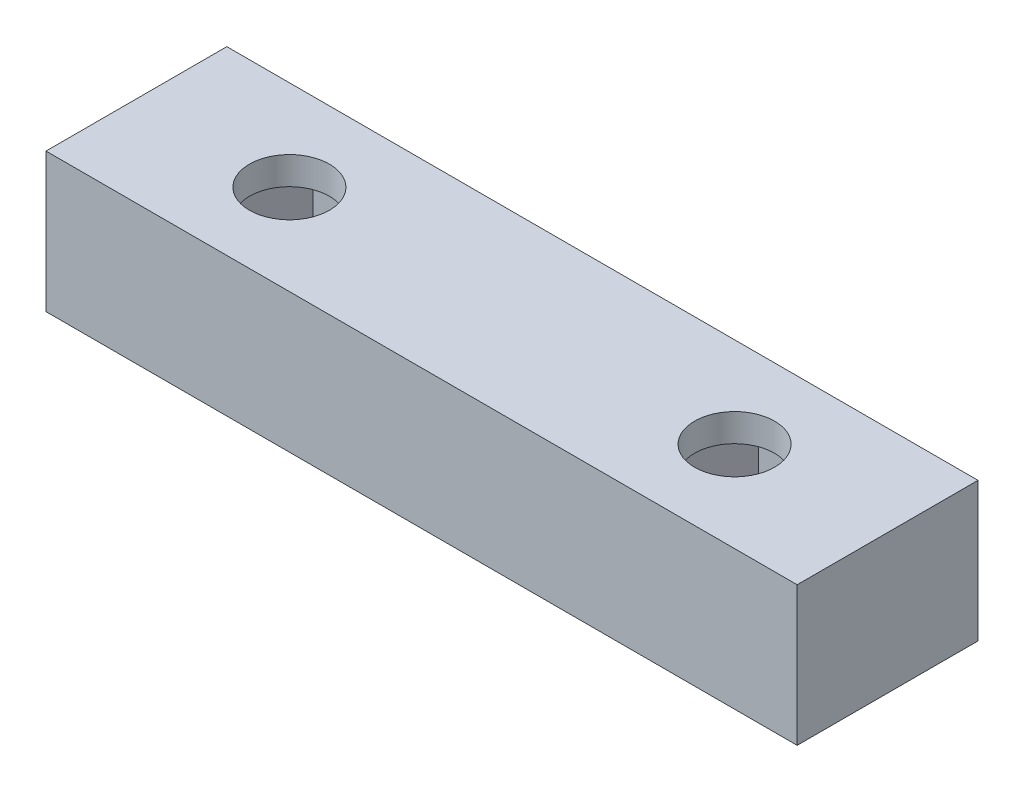
ISO-10303-21;
HEADER;
FILE_DESCRIPTION(('STEP AP214'),'2;1');
FILE_NAME('part.step','',(''),(''),'','','');
FILE_SCHEMA(('AUTOMOTIVE_DESIGN { 1 0 10303 214 1 1 1 1 }'));
ENDSEC;
DATA;
#1=APPLICATION_CONTEXT('core data for automotive mechanical design processes');
#2=APPLICATION_PROTOCOL_DEFINITION('international standard','automotive_design',2000,#1);
#3=PRODUCT_CONTEXT('',#1,'mechanical');
#4=PRODUCT('Part','Part','',(#3));
#5=PRODUCT_RELATED_PRODUCT_CATEGORY('part','',(#4));
#6=PRODUCT_DEFINITION_FORMATION('','',#4);
#7=PRODUCT_DEFINITION_CONTEXT('part definition',#1,'design');
#8=PRODUCT_DEFINITION('design','',#6,#7);
#9=PRODUCT_DEFINITION_SHAPE('','',#8);
#10=(LENGTH_UNIT() NAMED_UNIT(*) SI_UNIT(.MILLI.,.METRE.));
#11=(NAMED_UNIT(*) PLANE_ANGLE_UNIT() SI_UNIT($,.RADIAN.));
#12=(NAMED_UNIT(*) SI_UNIT($,.STERADIAN.) SOLID_ANGLE_UNIT());
#13=UNCERTAINTY_MEASURE_WITH_UNIT(LENGTH_MEASURE(1.E-05),#10,'distance_accuracy_value','');
#14=(GEOMETRIC_REPRESENTATION_CONTEXT(3) GLOBAL_UNCERTAINTY_ASSIGNED_CONTEXT((#13)) GLOBAL_UNIT_ASSIGNED_CONTEXT((#10,
#11,#12)) REPRESENTATION_CONTEXT('',''));
#15=CARTESIAN_POINT('',(0.,0.,0.));
#16=DIRECTION('',(0.,0.,1.));
#17=DIRECTION('',(1.,0.,0.));
#18=AXIS2_PLACEMENT_3D('',#15,#16,#17);
#19=CARTESIAN_POINT('',(0.,0.,0.));
#20=DIRECTION('',(0.,1.,0.));
#21=DIRECTION('',(0.,0.,1.));
#22=AXIS2_PLACEMENT_3D('',#19,#20,#21);
#23=PLANE('',#22);
#24=DIRECTION('',(0.499999999999999,0.,0.866025403784439));
#25=VECTOR('',#24,1.);
#26=CARTESIAN_POINT('',(-20.676537180436,0.,0.));
#27=LINE('',#26,#25);
#28=CARTESIAN_POINT('',(-20.676537180436,0.,0.));
#29=VERTEX_POINT('',#28);
#30=CARTESIAN_POINT('',(-18.338268590218,0.,4.05000000000001));
#31=VERTEX_POINT('',#30);
#32=EDGE_CURVE('E58',#29,#31,#27,.T.);
#33=ORIENTED_EDGE('',*,*,#32,.T.);
#34=DIRECTION('',(1.,0.,0.));
#35=VECTOR('',#34,1.);
#36=CARTESIAN_POINT('',(-18.338268590218,0.,4.05000000000001));
#37=LINE('',#36,#35);
#38=CARTESIAN_POINT('',(-13.661731409782,0.,4.05000000000001));
#39=VERTEX_POINT('',#38);
#40=EDGE_CURVE('E212',#31,#39,#37,.T.);
#41=ORIENTED_EDGE('',*,*,#40,.T.);
#42=DIRECTION('',(0.5,0.,-0.866025403784439));
#43=VECTOR('',#42,1.);
#44=CARTESIAN_POINT('',(-13.661731409782,0.,4.05000000000001));
#45=LINE('',#44,#43);
#46=CARTESIAN_POINT('',(-11.323462819564,0.,0.));
#47=VERTEX_POINT('',#46);
#48=EDGE_CURVE('E215',#39,#47,#45,.T.);
#49=ORIENTED_EDGE('',*,*,#48,.T.);
#50=DIRECTION('',(-0.5,0.,-0.866025403784439));
#51=VECTOR('',#50,1.);
#52=CARTESIAN_POINT('',(-11.323462819564,0.,0.));
#53=LINE('',#52,#51);
#54=CARTESIAN_POINT('',(-13.661731409782,0.,-4.04999999999999));
#55=VERTEX_POINT('',#54);
#56=EDGE_CURVE('E218',#47,#55,#53,.T.);
#57=ORIENTED_EDGE('',*,*,#56,.T.);
#58=DIRECTION('',(-1.,0.,0.));
#59=VECTOR('',#58,1.);
#60=CARTESIAN_POINT('',(-13.661731409782,0.,-4.04999999999999));
#61=LINE('',#60,#59);
#62=CARTESIAN_POINT('',(-18.338268590218,0.,-4.04999999999999));
#63=VERTEX_POINT('',#62);
#64=EDGE_CURVE('E221',#55,#63,#61,.T.);
#65=ORIENTED_EDGE('',*,*,#64,.T.);
#66=DIRECTION('',(-0.5,0.,0.866025403784439));
#67=VECTOR('',#66,1.);
#68=CARTESIAN_POINT('',(-18.338268590218,0.,-4.04999999999999));
#69=LINE('',#68,#67);
#70=EDGE_CURVE('E200',#63,#29,#69,.T.);
#71=ORIENTED_EDGE('',*,*,#70,.T.);
#72=EDGE_LOOP('',(#33,#41,#49,#57,#65,#71));
#73=FACE_BOUND('',#72,.T.);
#74=DIRECTION('',(0.,0.,1.));
#75=VECTOR('',#74,1.);
#76=CARTESIAN_POINT('',(-27.,0.,-6.5));
#77=LINE('',#76,#75);
#78=CARTESIAN_POINT('',(-27.,0.,-6.5));
#79=VERTEX_POINT('',#78);
#80=CARTESIAN_POINT('',(-27.,0.,6.5));
#81=VERTEX_POINT('',#80);
#82=EDGE_CURVE('E237',#79,#81,#77,.T.);
#83=ORIENTED_EDGE('',*,*,#82,.F.);
#84=DIRECTION('',(1.,0.,0.));
#85=VECTOR('',#84,1.);
#86=CARTESIAN_POINT('',(-27.,0.,-6.5));
#87=LINE('',#86,#85);
#88=CARTESIAN_POINT('',(27.,0.,-6.5));
#89=VERTEX_POINT('',#88);
#90=EDGE_CURVE('E242',#79,#89,#87,.T.);
#91=ORIENTED_EDGE('',*,*,#90,.T.);
#92=DIRECTION('',(0.,0.,1.));
#93=VECTOR('',#92,1.);
#94=CARTESIAN_POINT('',(27.,0.,-6.5));
#95=LINE('',#94,#93);
#96=CARTESIAN_POINT('',(27.,0.,6.5));
#97=VERTEX_POINT('',#96);
#98=EDGE_CURVE('E256',#89,#97,#95,.T.);
#99=ORIENTED_EDGE('',*,*,#98,.T.);
#100=DIRECTION('',(1.,0.,0.));
#101=VECTOR('',#100,1.);
#102=CARTESIAN_POINT('',(-27.,0.,6.5));
#103=LINE('',#102,#101);
#104=EDGE_CURVE('E253',#81,#97,#103,.T.);
#105=ORIENTED_EDGE('',*,*,#104,.F.);
#106=EDGE_LOOP('',(#83,#91,#99,#105));
#107=FACE_BOUND('',#106,.T.);
#108=DIRECTION('',(0.5,0.,-0.866025403784438));
#109=VECTOR('',#108,1.);
#110=CARTESIAN_POINT('',(18.338268590218,0.,4.05));
#111=LINE('',#110,#109);
#112=CARTESIAN_POINT('',(18.338268590218,0.,4.05));
#113=VERTEX_POINT('',#112);
#114=CARTESIAN_POINT('',(20.676537180436,0.,0.));
#115=VERTEX_POINT('',#114);
#116=EDGE_CURVE('E50',#113,#115,#111,.T.);
#117=ORIENTED_EDGE('',*,*,#116,.T.);
#118=DIRECTION('',(-0.500000000000001,0.,-0.866025403784438));
#119=VECTOR('',#118,1.);
#120=CARTESIAN_POINT('',(20.676537180436,0.,0.));
#121=LINE('',#120,#119);
#122=CARTESIAN_POINT('',(18.338268590218,0.,-4.04999999999999));
#123=VERTEX_POINT('',#122);
#124=EDGE_CURVE('E181',#115,#123,#121,.T.);
#125=ORIENTED_EDGE('',*,*,#124,.T.);
#126=DIRECTION('',(-1.,0.,0.));
#127=VECTOR('',#126,1.);
#128=CARTESIAN_POINT('',(18.338268590218,0.,-4.04999999999999));
#129=LINE('',#128,#127);
#130=CARTESIAN_POINT('',(13.661731409782,0.,-4.04999999999999));
#131=VERTEX_POINT('',#130);
#132=EDGE_CURVE('E176',#123,#131,#129,.T.);
#133=ORIENTED_EDGE('',*,*,#132,.T.);
#134=DIRECTION('',(-0.5,0.,0.866025403784439));
#135=VECTOR('',#134,1.);
#136=CARTESIAN_POINT('',(13.661731409782,0.,-4.04999999999999));
#137=LINE('',#136,#135);
#138=CARTESIAN_POINT('',(11.323462819564,0.,0.));
#139=VERTEX_POINT('',#138);
#140=EDGE_CURVE('E174',#131,#139,#137,.T.);
#141=ORIENTED_EDGE('',*,*,#140,.T.);
#142=DIRECTION('',(0.5,0.,0.866025403784439));
#143=VECTOR('',#142,1.);
#144=CARTESIAN_POINT('',(11.323462819564,0.,0.));
#145=LINE('',#144,#143);
#146=CARTESIAN_POINT('',(13.661731409782,0.,4.05000000000001));
#147=VERTEX_POINT('',#146);
#148=EDGE_CURVE('E157',#139,#147,#145,.T.);
#149=ORIENTED_EDGE('',*,*,#148,.T.);
#150=DIRECTION('',(1.,0.,0.));
#151=VECTOR('',#150,1.);
#152=CARTESIAN_POINT('',(13.661731409782,0.,4.05000000000001));
#153=LINE('',#152,#151);
#154=EDGE_CURVE('E167',#147,#113,#153,.T.);
#155=ORIENTED_EDGE('',*,*,#154,.T.);
#156=EDGE_LOOP('',(#117,#125,#133,#141,#149,#155));
#157=FACE_BOUND('',#156,.T.);
#158=ADVANCED_FACE('F33',(#73,#107,#157),#23,.F.);
#159=CARTESIAN_POINT('',(-27.,10.,-6.5));
#160=DIRECTION('',(1.,0.,0.));
#161=DIRECTION('',(0.,0.,-1.));
#162=AXIS2_PLACEMENT_3D('',#159,#160,#161);
#163=PLANE('',#162);
#164=ORIENTED_EDGE('',*,*,#82,.T.);
#165=DIRECTION('',(0.,-1.,0.));
#166=VECTOR('',#165,1.);
#167=CARTESIAN_POINT('',(-27.,10.,6.5));
#168=LINE('',#167,#166);
#169=CARTESIAN_POINT('',(-27.,10.,6.5));
#170=VERTEX_POINT('',#169);
#171=EDGE_CURVE('E11',#170,#81,#168,.T.);
#172=ORIENTED_EDGE('',*,*,#171,.F.);
#173=DIRECTION('',(0.,0.,1.));
#174=VECTOR('',#173,1.);
#175=CARTESIAN_POINT('',(-27.,10.,-6.5));
#176=LINE('',#175,#174);
#177=CARTESIAN_POINT('',(-27.,10.,-6.5));
#178=VERTEX_POINT('',#177);
#179=EDGE_CURVE('E238',#178,#170,#176,.T.);
#180=ORIENTED_EDGE('',*,*,#179,.F.);
#181=DIRECTION('',(0.,-1.,0.));
#182=VECTOR('',#181,1.);
#183=CARTESIAN_POINT('',(-27.,10.,-6.5));
#184=LINE('',#183,#182);
#185=EDGE_CURVE('E250',#178,#79,#184,.T.);
#186=ORIENTED_EDGE('',*,*,#185,.T.);
#187=EDGE_LOOP('',(#164,#172,#180,#186));
#188=FACE_BOUND('',#187,.T.);
#189=ADVANCED_FACE('F35',(#188),#163,.F.);
#190=CARTESIAN_POINT('',(-27.,10.,6.5));
#191=DIRECTION('',(0.,0.,-1.));
#192=DIRECTION('',(-1.,0.,0.));
#193=AXIS2_PLACEMENT_3D('',#190,#191,#192);
#194=PLANE('',#193);
#195=ORIENTED_EDGE('',*,*,#104,.T.);
#196=DIRECTION('',(0.,-1.,0.));
#197=VECTOR('',#196,1.);
#198=CARTESIAN_POINT('',(27.,10.,6.5));
#199=LINE('',#198,#197);
#200=CARTESIAN_POINT('',(27.,10.,6.5));
#201=VERTEX_POINT('',#200);
#202=EDGE_CURVE('E42',#201,#97,#199,.T.);
#203=ORIENTED_EDGE('',*,*,#202,.F.);
#204=DIRECTION('',(1.,0.,0.));
#205=VECTOR('',#204,1.);
#206=CARTESIAN_POINT('',(-27.,10.,6.5));
#207=LINE('',#206,#205);
#208=EDGE_CURVE('E241',#170,#201,#207,.T.);
#209=ORIENTED_EDGE('',*,*,#208,.F.);
#210=ORIENTED_EDGE('',*,*,#171,.T.);
#211=EDGE_LOOP('',(#195,#203,#209,#210));
#212=FACE_BOUND('',#211,.T.);
#213=ADVANCED_FACE('F313',(#212),#194,.F.);
#214=CARTESIAN_POINT('',(27.,10.,-6.5));
#215=DIRECTION('',(1.,0.,0.));
#216=DIRECTION('',(0.,0.,-1.));
#217=AXIS2_PLACEMENT_3D('',#214,#215,#216);
#218=PLANE('',#217);
#219=ORIENTED_EDGE('',*,*,#98,.F.);
#220=DIRECTION('',(0.,-1.,0.));
#221=VECTOR('',#220,1.);
#222=CARTESIAN_POINT('',(27.,10.,-6.5));
#223=LINE('',#222,#221);
#224=CARTESIAN_POINT('',(27.,10.,-6.5));
#225=VERTEX_POINT('',#224);
#226=EDGE_CURVE('E262',#225,#89,#223,.T.);
#227=ORIENTED_EDGE('',*,*,#226,.F.);
#228=DIRECTION('',(0.,0.,1.));
#229=VECTOR('',#228,1.);
#230=CARTESIAN_POINT('',(27.,10.,-6.5));
#231=LINE('',#230,#229);
#232=EDGE_CURVE('E244',#225,#201,#231,.T.);
#233=ORIENTED_EDGE('',*,*,#232,.T.);
#234=ORIENTED_EDGE('',*,*,#202,.T.);
#235=EDGE_LOOP('',(#219,#227,#233,#234));
#236=FACE_BOUND('',#235,.T.);
#237=ADVANCED_FACE('F323',(#236),#218,.T.);
#238=CARTESIAN_POINT('',(-27.,10.,-6.5));
#239=DIRECTION('',(0.,0.,-1.));
#240=DIRECTION('',(-1.,0.,0.));
#241=AXIS2_PLACEMENT_3D('',#238,#239,#240);
#242=PLANE('',#241);
#243=ORIENTED_EDGE('',*,*,#90,.F.);
#244=ORIENTED_EDGE('',*,*,#185,.F.);
#245=DIRECTION('',(1.,0.,0.));
#246=VECTOR('',#245,1.);
#247=CARTESIAN_POINT('',(-27.,10.,-6.5));
#248=LINE('',#247,#246);
#249=EDGE_CURVE('E247',#178,#225,#248,.T.);
#250=ORIENTED_EDGE('',*,*,#249,.T.);
#251=ORIENTED_EDGE('',*,*,#226,.T.);
#252=EDGE_LOOP('',(#243,#244,#250,#251));
#253=FACE_BOUND('',#252,.T.);
#254=ADVANCED_FACE('F320',(#253),#242,.T.);
#255=CARTESIAN_POINT('',(0.,10.,0.));
#256=DIRECTION('',(0.,1.,0.));
#257=DIRECTION('',(0.,0.,1.));
#258=AXIS2_PLACEMENT_3D('',#255,#256,#257);
#259=PLANE('',#258);
#260=CARTESIAN_POINT('',(16.,10.,0.));
#261=DIRECTION('',(0.,1.,0.));
#262=DIRECTION('',(0.,0.,1.));
#263=AXIS2_PLACEMENT_3D('',#260,#261,#262);
#264=CIRCLE('',#263,2.875);
#265=CARTESIAN_POINT('',(16.,10.,2.87499999999999));
#266=VERTEX_POINT('',#265);
#267=EDGE_CURVE('E277',#266,#266,#264,.T.);
#268=ORIENTED_EDGE('',*,*,#267,.F.);
#269=EDGE_LOOP('',(#268));
#270=FACE_BOUND('',#269,.T.);
#271=CARTESIAN_POINT('',(-16.,10.,0.));
#272=DIRECTION('',(0.,1.,0.));
#273=DIRECTION('',(0.,0.,1.));
#274=AXIS2_PLACEMENT_3D('',#271,#272,#273);
#275=CIRCLE('',#274,2.875);
#276=CARTESIAN_POINT('',(-16.,10.,2.875));
#277=VERTEX_POINT('',#276);
#278=EDGE_CURVE('E267',#277,#277,#275,.T.);
#279=ORIENTED_EDGE('',*,*,#278,.F.);
#280=EDGE_LOOP('',(#279));
#281=FACE_BOUND('',#280,.T.);
#282=ORIENTED_EDGE('',*,*,#179,.T.);
#283=ORIENTED_EDGE('',*,*,#208,.T.);
#284=ORIENTED_EDGE('',*,*,#232,.F.);
#285=ORIENTED_EDGE('',*,*,#249,.F.);
#286=EDGE_LOOP('',(#282,#283,#284,#285));
#287=FACE_BOUND('',#286,.T.);
#288=ADVANCED_FACE('F318',(#270,#281,#287),#259,.T.);
#289=CARTESIAN_POINT('',(-20.676537180436,8.,0.));
#290=DIRECTION('',(0.866025403784439,0.,-0.499999999999999));
#291=DIRECTION('',(-0.499999999999999,0.,-0.866025403784439));
#292=AXIS2_PLACEMENT_3D('',#289,#290,#291);
#293=PLANE('',#292);
#294=ORIENTED_EDGE('',*,*,#32,.F.);
#295=DIRECTION('',(0.,-1.,0.));
#296=VECTOR('',#295,1.);
#297=CARTESIAN_POINT('',(-20.676537180436,8.,0.));
#298=LINE('',#297,#296);
#299=CARTESIAN_POINT('',(-20.676537180436,8.,0.));
#300=VERTEX_POINT('',#299);
#301=EDGE_CURVE('E210',#300,#29,#298,.T.);
#302=ORIENTED_EDGE('',*,*,#301,.F.);
#303=DIRECTION('',(0.499999999999999,0.,0.866025403784439));
#304=VECTOR('',#303,1.);
#305=CARTESIAN_POINT('',(-20.676537180436,8.,0.));
#306=LINE('',#305,#304);
#307=CARTESIAN_POINT('',(-18.338268590218,8.,4.05000000000001));
#308=VERTEX_POINT('',#307);
#309=EDGE_CURVE('E196',#300,#308,#306,.T.);
#310=ORIENTED_EDGE('',*,*,#309,.T.);
#311=DIRECTION('',(0.,-1.,0.));
#312=VECTOR('',#311,1.);
#313=CARTESIAN_POINT('',(-18.338268590218,8.,4.05000000000001));
#314=LINE('',#313,#312);
#315=EDGE_CURVE('E235',#308,#31,#314,.T.);
#316=ORIENTED_EDGE('',*,*,#315,.T.);
#317=EDGE_LOOP('',(#294,#302,#310,#316));
#318=FACE_BOUND('',#317,.T.);
#319=ADVANCED_FACE('F341',(#318),#293,.T.);
#320=CARTESIAN_POINT('',(-18.338268590218,8.,4.05000000000001));
#321=DIRECTION('',(0.,0.,-1.));
#322=DIRECTION('',(-1.,0.,0.));
#323=AXIS2_PLACEMENT_3D('',#320,#321,#322);
#324=PLANE('',#323);
#325=ORIENTED_EDGE('',*,*,#40,.F.);
#326=ORIENTED_EDGE('',*,*,#315,.F.);
#327=DIRECTION('',(1.,0.,0.));
#328=VECTOR('',#327,1.);
#329=CARTESIAN_POINT('',(-18.338268590218,8.,4.05000000000001));
#330=LINE('',#329,#328);
#331=CARTESIAN_POINT('',(-13.661731409782,8.,4.05000000000001));
#332=VERTEX_POINT('',#331);
#333=EDGE_CURVE('E199',#308,#332,#330,.T.);
#334=ORIENTED_EDGE('',*,*,#333,.T.);
#335=DIRECTION('',(0.,-1.,0.));
#336=VECTOR('',#335,1.);
#337=CARTESIAN_POINT('',(-13.661731409782,8.,4.05000000000001));
#338=LINE('',#337,#336);
#339=EDGE_CURVE('E233',#332,#39,#338,.T.);
#340=ORIENTED_EDGE('',*,*,#339,.T.);
#341=EDGE_LOOP('',(#325,#326,#334,#340));
#342=FACE_BOUND('',#341,.T.);
#343=ADVANCED_FACE('F346',(#342),#324,.T.);
#344=CARTESIAN_POINT('',(-13.661731409782,8.,4.05000000000001));
#345=DIRECTION('',(-0.866025403784439,0.,-0.5));
#346=DIRECTION('',(-0.5,0.,0.866025403784439));
#347=AXIS2_PLACEMENT_3D('',#344,#345,#346);
#348=PLANE('',#347);
#349=ORIENTED_EDGE('',*,*,#48,.F.);
#350=ORIENTED_EDGE('',*,*,#339,.F.);
#351=DIRECTION('',(0.5,0.,-0.866025403784439));
#352=VECTOR('',#351,1.);
#353=CARTESIAN_POINT('',(-13.661731409782,8.,4.05000000000001));
#354=LINE('',#353,#352);
#355=CARTESIAN_POINT('',(-11.323462819564,8.,0.));
#356=VERTEX_POINT('',#355);
#357=EDGE_CURVE('E202',#332,#356,#354,.T.);
#358=ORIENTED_EDGE('',*,*,#357,.T.);
#359=DIRECTION('',(0.,-1.,0.));
#360=VECTOR('',#359,1.);
#361=CARTESIAN_POINT('',(-11.323462819564,8.,0.));
#362=LINE('',#361,#360);
#363=EDGE_CURVE('E231',#356,#47,#362,.T.);
#364=ORIENTED_EDGE('',*,*,#363,.T.);
#365=EDGE_LOOP('',(#349,#350,#358,#364));
#366=FACE_BOUND('',#365,.T.);
#367=ADVANCED_FACE('F383',(#366),#348,.T.);
#368=CARTESIAN_POINT('',(-11.323462819564,8.,0.));
#369=DIRECTION('',(-0.866025403784439,0.,0.5));
#370=DIRECTION('',(0.5,0.,0.866025403784439));
#371=AXIS2_PLACEMENT_3D('',#368,#369,#370);
#372=PLANE('',#371);
#373=ORIENTED_EDGE('',*,*,#56,.F.);
#374=ORIENTED_EDGE('',*,*,#363,.F.);
#375=DIRECTION('',(-0.5,0.,-0.866025403784439));
#376=VECTOR('',#375,1.);
#377=CARTESIAN_POINT('',(-11.323462819564,8.,0.));
#378=LINE('',#377,#376);
#379=CARTESIAN_POINT('',(-13.661731409782,8.,-4.04999999999999));
#380=VERTEX_POINT('',#379);
#381=EDGE_CURVE('E204',#356,#380,#378,.T.);
#382=ORIENTED_EDGE('',*,*,#381,.T.);
#383=DIRECTION('',(0.,-1.,0.));
#384=VECTOR('',#383,1.);
#385=CARTESIAN_POINT('',(-13.661731409782,8.,-4.04999999999999));
#386=LINE('',#385,#384);
#387=EDGE_CURVE('E229',#380,#55,#386,.T.);
#388=ORIENTED_EDGE('',*,*,#387,.T.);
#389=EDGE_LOOP('',(#373,#374,#382,#388));
#390=FACE_BOUND('',#389,.T.);
#391=ADVANCED_FACE('F379',(#390),#372,.T.);
#392=CARTESIAN_POINT('',(-13.661731409782,8.,-4.04999999999999));
#393=DIRECTION('',(0.,0.,1.));
#394=DIRECTION('',(1.,0.,0.));
#395=AXIS2_PLACEMENT_3D('',#392,#393,#394);
#396=PLANE('',#395);
#397=ORIENTED_EDGE('',*,*,#64,.F.);
#398=ORIENTED_EDGE('',*,*,#387,.F.);
#399=DIRECTION('',(-1.,0.,0.));
#400=VECTOR('',#399,1.);
#401=CARTESIAN_POINT('',(-13.661731409782,8.,-4.04999999999999));
#402=LINE('',#401,#400);
#403=CARTESIAN_POINT('',(-18.338268590218,8.,-4.04999999999999));
#404=VERTEX_POINT('',#403);
#405=EDGE_CURVE('E206',#380,#404,#402,.T.);
#406=ORIENTED_EDGE('',*,*,#405,.T.);
#407=DIRECTION('',(0.,-1.,0.));
#408=VECTOR('',#407,1.);
#409=CARTESIAN_POINT('',(-18.338268590218,8.,-4.04999999999999));
#410=LINE('',#409,#408);
#411=EDGE_CURVE('E227',#404,#63,#410,.T.);
#412=ORIENTED_EDGE('',*,*,#411,.T.);
#413=EDGE_LOOP('',(#397,#398,#406,#412));
#414=FACE_BOUND('',#413,.T.);
#415=ADVANCED_FACE('F375',(#414),#396,.T.);
#416=CARTESIAN_POINT('',(-18.338268590218,8.,-4.04999999999999));
#417=DIRECTION('',(0.866025403784439,0.,0.5));
#418=DIRECTION('',(0.5,0.,-0.866025403784439));
#419=AXIS2_PLACEMENT_3D('',#416,#417,#418);
#420=PLANE('',#419);
#421=ORIENTED_EDGE('',*,*,#70,.F.);
#422=ORIENTED_EDGE('',*,*,#411,.F.);
#423=DIRECTION('',(-0.5,0.,0.866025403784439));
#424=VECTOR('',#423,1.);
#425=CARTESIAN_POINT('',(-18.338268590218,8.,-4.04999999999999));
#426=LINE('',#425,#424);
#427=EDGE_CURVE('E208',#404,#300,#426,.T.);
#428=ORIENTED_EDGE('',*,*,#427,.T.);
#429=ORIENTED_EDGE('',*,*,#301,.T.);
#430=EDGE_LOOP('',(#421,#422,#428,#429));
#431=FACE_BOUND('',#430,.T.);
#432=ADVANCED_FACE('F371',(#431),#420,.T.);
#433=CARTESIAN_POINT('',(0.,8.,0.));
#434=DIRECTION('',(0.,1.,0.));
#435=DIRECTION('',(0.,0.,1.));
#436=AXIS2_PLACEMENT_3D('',#433,#434,#435);
#437=PLANE('',#436);
#438=CARTESIAN_POINT('',(-16.,8.,0.));
#439=DIRECTION('',(0.,1.,0.));
#440=DIRECTION('',(0.,0.,1.));
#441=AXIS2_PLACEMENT_3D('',#438,#439,#440);
#442=CIRCLE('',#441,2.875);
#443=CARTESIAN_POINT('',(-16.,8.,2.875));
#444=VERTEX_POINT('',#443);
#445=EDGE_CURVE('E264',#444,#444,#442,.F.);
#446=ORIENTED_EDGE('',*,*,#445,.F.);
#447=EDGE_LOOP('',(#446));
#448=FACE_BOUND('',#447,.T.);
#449=ORIENTED_EDGE('',*,*,#309,.F.);
#450=ORIENTED_EDGE('',*,*,#427,.F.);
#451=ORIENTED_EDGE('',*,*,#405,.F.);
#452=ORIENTED_EDGE('',*,*,#381,.F.);
#453=ORIENTED_EDGE('',*,*,#357,.F.);
#454=ORIENTED_EDGE('',*,*,#333,.F.);
#455=EDGE_LOOP('',(#449,#450,#451,#452,#453,#454));
#456=FACE_BOUND('',#455,.T.);
#457=ADVANCED_FACE('F368',(#448,#456),#437,.F.);
#458=CARTESIAN_POINT('',(18.338268590218,8.,4.05));
#459=DIRECTION('',(-0.866025403784438,0.,-0.5));
#460=DIRECTION('',(-0.5,0.,0.866025403784439));
#461=AXIS2_PLACEMENT_3D('',#458,#459,#460);
#462=PLANE('',#461);
#463=ORIENTED_EDGE('',*,*,#116,.F.);
#464=DIRECTION('',(0.,-1.,0.));
#465=VECTOR('',#464,1.);
#466=CARTESIAN_POINT('',(18.338268590218,8.,4.05));
#467=LINE('',#466,#465);
#468=CARTESIAN_POINT('',(18.338268590218,8.,4.05));
#469=VERTEX_POINT('',#468);
#470=EDGE_CURVE('E163',#469,#113,#467,.T.);
#471=ORIENTED_EDGE('',*,*,#470,.F.);
#472=DIRECTION('',(0.5,0.,-0.866025403784438));
#473=VECTOR('',#472,1.);
#474=CARTESIAN_POINT('',(18.338268590218,8.,4.05));
#475=LINE('',#474,#473);
#476=CARTESIAN_POINT('',(20.676537180436,8.,0.));
#477=VERTEX_POINT('',#476);
#478=EDGE_CURVE('E170',#469,#477,#475,.T.);
#479=ORIENTED_EDGE('',*,*,#478,.T.);
#480=DIRECTION('',(0.,-1.,0.));
#481=VECTOR('',#480,1.);
#482=CARTESIAN_POINT('',(20.676537180436,8.,0.));
#483=LINE('',#482,#481);
#484=EDGE_CURVE('E266',#477,#115,#483,.T.);
#485=ORIENTED_EDGE('',*,*,#484,.T.);
#486=EDGE_LOOP('',(#463,#471,#479,#485));
#487=FACE_BOUND('',#486,.T.);
#488=ADVANCED_FACE('F291',(#487),#462,.T.);
#489=CARTESIAN_POINT('',(20.676537180436,8.,0.));
#490=DIRECTION('',(-0.866025403784438,0.,0.500000000000001));
#491=DIRECTION('',(0.500000000000001,0.,0.866025403784438));
#492=AXIS2_PLACEMENT_3D('',#489,#490,#491);
#493=PLANE('',#492);
#494=ORIENTED_EDGE('',*,*,#124,.F.);
#495=ORIENTED_EDGE('',*,*,#484,.F.);
#496=DIRECTION('',(-0.500000000000001,0.,-0.866025403784438));
#497=VECTOR('',#496,1.);
#498=CARTESIAN_POINT('',(20.676537180436,8.,0.));
#499=LINE('',#498,#497);
#500=CARTESIAN_POINT('',(18.338268590218,8.,-4.04999999999999));
#501=VERTEX_POINT('',#500);
#502=EDGE_CURVE('E192',#477,#501,#499,.T.);
#503=ORIENTED_EDGE('',*,*,#502,.T.);
#504=DIRECTION('',(0.,-1.,0.));
#505=VECTOR('',#504,1.);
#506=CARTESIAN_POINT('',(18.338268590218,8.,-4.04999999999999));
#507=LINE('',#506,#505);
#508=EDGE_CURVE('E270',#501,#123,#507,.T.);
#509=ORIENTED_EDGE('',*,*,#508,.T.);
#510=EDGE_LOOP('',(#494,#495,#503,#509));
#511=FACE_BOUND('',#510,.T.);
#512=ADVANCED_FACE('F294',(#511),#493,.T.);
#513=CARTESIAN_POINT('',(18.338268590218,8.,-4.04999999999999));
#514=DIRECTION('',(0.,0.,1.));
#515=DIRECTION('',(1.,0.,0.));
#516=AXIS2_PLACEMENT_3D('',#513,#514,#515);
#517=PLANE('',#516);
#518=ORIENTED_EDGE('',*,*,#132,.F.);
#519=ORIENTED_EDGE('',*,*,#508,.F.);
#520=DIRECTION('',(-1.,0.,0.));
#521=VECTOR('',#520,1.);
#522=CARTESIAN_POINT('',(18.338268590218,8.,-4.04999999999999));
#523=LINE('',#522,#521);
#524=CARTESIAN_POINT('',(13.661731409782,8.,-4.04999999999999));
#525=VERTEX_POINT('',#524);
#526=EDGE_CURVE('E190',#501,#525,#523,.T.);
#527=ORIENTED_EDGE('',*,*,#526,.T.);
#528=DIRECTION('',(0.,-1.,0.));
#529=VECTOR('',#528,1.);
#530=CARTESIAN_POINT('',(13.661731409782,8.,-4.04999999999999));
#531=LINE('',#530,#529);
#532=EDGE_CURVE('E281',#525,#131,#531,.T.);
#533=ORIENTED_EDGE('',*,*,#532,.T.);
#534=EDGE_LOOP('',(#518,#519,#527,#533));
#535=FACE_BOUND('',#534,.T.);
#536=ADVANCED_FACE('F298',(#535),#517,.T.);
#537=CARTESIAN_POINT('',(13.661731409782,8.,-4.04999999999999));
#538=DIRECTION('',(0.866025403784439,0.,0.5));
#539=DIRECTION('',(0.5,0.,-0.866025403784439));
#540=AXIS2_PLACEMENT_3D('',#537,#538,#539);
#541=PLANE('',#540);
#542=ORIENTED_EDGE('',*,*,#140,.F.);
#543=ORIENTED_EDGE('',*,*,#532,.F.);
#544=DIRECTION('',(-0.5,0.,0.866025403784439));
#545=VECTOR('',#544,1.);
#546=CARTESIAN_POINT('',(13.661731409782,8.,-4.04999999999999));
#547=LINE('',#546,#545);
#548=CARTESIAN_POINT('',(11.323462819564,8.,0.));
#549=VERTEX_POINT('',#548);
#550=EDGE_CURVE('E188',#525,#549,#547,.T.);
#551=ORIENTED_EDGE('',*,*,#550,.T.);
#552=DIRECTION('',(0.,-1.,0.));
#553=VECTOR('',#552,1.);
#554=CARTESIAN_POINT('',(11.323462819564,8.,0.));
#555=LINE('',#554,#553);
#556=EDGE_CURVE('E164',#549,#139,#555,.T.);
#557=ORIENTED_EDGE('',*,*,#556,.T.);
#558=EDGE_LOOP('',(#542,#543,#551,#557));
#559=FACE_BOUND('',#558,.T.);
#560=ADVANCED_FACE('F284',(#559),#541,.T.);
#561=CARTESIAN_POINT('',(11.323462819564,8.,0.));
#562=DIRECTION('',(0.866025403784439,0.,-0.499999999999999));
#563=DIRECTION('',(-0.5,0.,-0.866025403784439));
#564=AXIS2_PLACEMENT_3D('',#561,#562,#563);
#565=PLANE('',#564);
#566=ORIENTED_EDGE('',*,*,#148,.F.);
#567=ORIENTED_EDGE('',*,*,#556,.F.);
#568=DIRECTION('',(0.5,0.,0.866025403784439));
#569=VECTOR('',#568,1.);
#570=CARTESIAN_POINT('',(11.323462819564,8.,0.));
#571=LINE('',#570,#569);
#572=CARTESIAN_POINT('',(13.661731409782,8.,4.05000000000001));
#573=VERTEX_POINT('',#572);
#574=EDGE_CURVE('E160',#549,#573,#571,.T.);
#575=ORIENTED_EDGE('',*,*,#574,.T.);
#576=DIRECTION('',(0.,-1.,0.));
#577=VECTOR('',#576,1.);
#578=CARTESIAN_POINT('',(13.661731409782,8.,4.05000000000001));
#579=LINE('',#578,#577);
#580=EDGE_CURVE('E152',#573,#147,#579,.T.);
#581=ORIENTED_EDGE('',*,*,#580,.T.);
#582=EDGE_LOOP('',(#566,#567,#575,#581));
#583=FACE_BOUND('',#582,.T.);
#584=ADVANCED_FACE('F154',(#583),#565,.T.);
#585=CARTESIAN_POINT('',(13.661731409782,8.,4.05000000000001));
#586=DIRECTION('',(0.,0.,-1.));
#587=DIRECTION('',(-1.,0.,0.));
#588=AXIS2_PLACEMENT_3D('',#585,#586,#587);
#589=PLANE('',#588);
#590=ORIENTED_EDGE('',*,*,#154,.F.);
#591=ORIENTED_EDGE('',*,*,#580,.F.);
#592=DIRECTION('',(1.,0.,0.));
#593=VECTOR('',#592,1.);
#594=CARTESIAN_POINT('',(13.661731409782,8.,4.05000000000001));
#595=LINE('',#594,#593);
#596=EDGE_CURVE('E185',#573,#469,#595,.T.);
#597=ORIENTED_EDGE('',*,*,#596,.T.);
#598=ORIENTED_EDGE('',*,*,#470,.T.);
#599=EDGE_LOOP('',(#590,#591,#597,#598));
#600=FACE_BOUND('',#599,.T.);
#601=ADVANCED_FACE('F168',(#600),#589,.T.);
#602=CARTESIAN_POINT('',(0.,8.,0.));
#603=DIRECTION('',(0.,1.,0.));
#604=DIRECTION('',(0.,0.,1.));
#605=AXIS2_PLACEMENT_3D('',#602,#603,#604);
#606=PLANE('',#605);
#607=CARTESIAN_POINT('',(16.,8.,0.));
#608=DIRECTION('',(0.,1.,0.));
#609=DIRECTION('',(0.,0.,1.));
#610=AXIS2_PLACEMENT_3D('',#607,#608,#609);
#611=CIRCLE('',#610,2.875);
#612=CARTESIAN_POINT('',(16.,8.,2.87499999999999));
#613=VERTEX_POINT('',#612);
#614=EDGE_CURVE('E37',#613,#613,#611,.F.);
#615=ORIENTED_EDGE('',*,*,#614,.F.);
#616=EDGE_LOOP('',(#615));
#617=FACE_BOUND('',#616,.T.);
#618=ORIENTED_EDGE('',*,*,#478,.F.);
#619=ORIENTED_EDGE('',*,*,#596,.F.);
#620=ORIENTED_EDGE('',*,*,#574,.F.);
#621=ORIENTED_EDGE('',*,*,#550,.F.);
#622=ORIENTED_EDGE('',*,*,#526,.F.);
#623=ORIENTED_EDGE('',*,*,#502,.F.);
#624=EDGE_LOOP('',(#618,#619,#620,#621,#622,#623));
#625=FACE_BOUND('',#624,.T.);
#626=ADVANCED_FACE('F289',(#617,#625),#606,.F.);
#627=CARTESIAN_POINT('',(-16.,10.,0.));
#628=DIRECTION('',(0.,-1.,0.));
#629=DIRECTION('',(0.,0.,-1.));
#630=AXIS2_PLACEMENT_3D('',#627,#628,#629);
#631=CYLINDRICAL_SURFACE('',#630,2.875);
#632=ORIENTED_EDGE('',*,*,#278,.T.);
#633=EDGE_LOOP('',(#632));
#634=FACE_BOUND('',#633,.T.);
#635=ORIENTED_EDGE('',*,*,#445,.T.);
#636=EDGE_LOOP('',(#635));
#637=FACE_BOUND('',#636,.T.);
#638=ADVANCED_FACE('F354',(#634,#637),#631,.F.);
#639=CARTESIAN_POINT('',(16.,10.,0.));
#640=DIRECTION('',(0.,-1.,0.));
#641=DIRECTION('',(0.,0.,-1.));
#642=AXIS2_PLACEMENT_3D('',#639,#640,#641);
#643=CYLINDRICAL_SURFACE('',#642,2.875);
#644=ORIENTED_EDGE('',*,*,#267,.T.);
#645=EDGE_LOOP('',(#644));
#646=FACE_BOUND('',#645,.T.);
#647=ORIENTED_EDGE('',*,*,#614,.T.);
#648=EDGE_LOOP('',(#647));
#649=FACE_BOUND('',#648,.T.);
#650=ADVANCED_FACE('F351',(#646,#649),#643,.F.);
#651=CLOSED_SHELL('',(#158,#189,#213,#237,#254,#288,#319,#343,#367,#391,#415,#432,#457,#488,
#512,#536,#560,#584,#601,#626,#638,#650));
#652=MANIFOLD_SOLID_BREP('B2',#651);
#653=ADVANCED_BREP_SHAPE_REPRESENTATION('',(#18,#652),#14);
#654=SHAPE_DEFINITION_REPRESENTATION(#9,#653);
ENDSEC;
END-ISO-10303-21;
